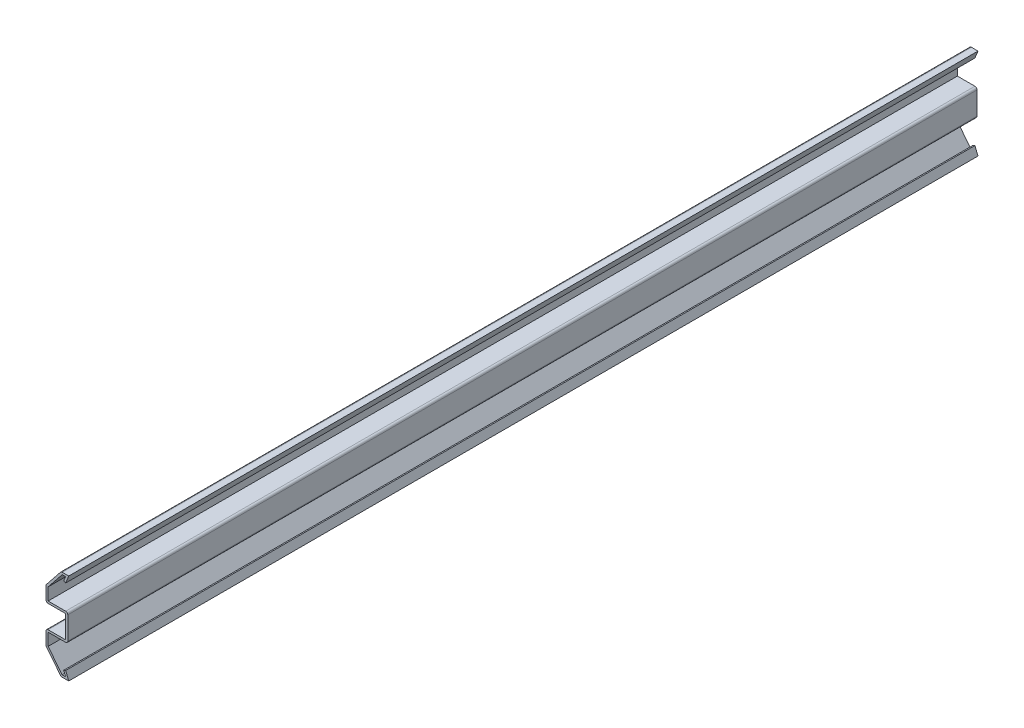
ISO-10303-21;
HEADER;
FILE_DESCRIPTION(('STEP AP214'),'2;1');
FILE_NAME('part.step','',(''),(''),'','','');
FILE_SCHEMA(('AUTOMOTIVE_DESIGN { 1 0 10303 214 1 1 1 1 }'));
ENDSEC;
DATA;
#1=APPLICATION_CONTEXT('core data for automotive mechanical design processes');
#2=APPLICATION_PROTOCOL_DEFINITION('international standard','automotive_design',2000,#1);
#3=PRODUCT_CONTEXT('',#1,'mechanical');
#4=PRODUCT('Part','Part','',(#3));
#5=PRODUCT_RELATED_PRODUCT_CATEGORY('part','',(#4));
#6=PRODUCT_DEFINITION_FORMATION('','',#4);
#7=PRODUCT_DEFINITION_CONTEXT('part definition',#1,'design');
#8=PRODUCT_DEFINITION('design','',#6,#7);
#9=PRODUCT_DEFINITION_SHAPE('','',#8);
#10=(LENGTH_UNIT() NAMED_UNIT(*) SI_UNIT(.MILLI.,.METRE.));
#11=(NAMED_UNIT(*) PLANE_ANGLE_UNIT() SI_UNIT($,.RADIAN.));
#12=(NAMED_UNIT(*) SI_UNIT($,.STERADIAN.) SOLID_ANGLE_UNIT());
#13=UNCERTAINTY_MEASURE_WITH_UNIT(LENGTH_MEASURE(1.E-05),#10,'distance_accuracy_value','');
#14=(GEOMETRIC_REPRESENTATION_CONTEXT(3) GLOBAL_UNCERTAINTY_ASSIGNED_CONTEXT((#13)) GLOBAL_UNIT_ASSIGNED_CONTEXT((#10,
#11,#12)) REPRESENTATION_CONTEXT('',''));
#15=CARTESIAN_POINT('',(0.,0.,0.));
#16=DIRECTION('',(0.,0.,1.));
#17=DIRECTION('',(1.,0.,0.));
#18=AXIS2_PLACEMENT_3D('',#15,#16,#17);
#19=CARTESIAN_POINT('',(-1.285875,3.175,-381.));
#20=DIRECTION('',(0.926870043752196,0.375382367719639,0.));
#21=DIRECTION('',(-0.375382367719639,0.926870043752196,0.));
#22=AXIS2_PLACEMENT_3D('',#19,#20,#21);
#23=PLANE('',#22);
#24=DIRECTION('',(-0.375382367719639,0.926870043752196,0.));
#25=VECTOR('',#24,1.);
#26=CARTESIAN_POINT('',(-1.285875,3.175,0.));
#27=LINE('',#26,#25);
#28=CARTESIAN_POINT('',(0.,0.,0.));
#29=VERTEX_POINT('',#28);
#30=CARTESIAN_POINT('',(-1.285875,3.175,0.));
#31=VERTEX_POINT('',#30);
#32=EDGE_CURVE('E327',#29,#31,#27,.T.);
#33=ORIENTED_EDGE('',*,*,#32,.F.);
#34=DIRECTION('',(0.,0.,1.));
#35=VECTOR('',#34,1.);
#36=CARTESIAN_POINT('',(0.,0.,-381.));
#37=LINE('',#36,#35);
#38=CARTESIAN_POINT('',(0.,0.,-381.));
#39=VERTEX_POINT('',#38);
#40=EDGE_CURVE('E270',#39,#29,#37,.T.);
#41=ORIENTED_EDGE('',*,*,#40,.F.);
#42=DIRECTION('',(-0.375382367719639,0.926870043752196,0.));
#43=VECTOR('',#42,1.);
#44=CARTESIAN_POINT('',(-1.285875,3.175,-381.));
#45=LINE('',#44,#43);
#46=CARTESIAN_POINT('',(-1.285875,3.175,-381.));
#47=VERTEX_POINT('',#46);
#48=EDGE_CURVE('E250',#39,#47,#45,.T.);
#49=ORIENTED_EDGE('',*,*,#48,.T.);
#50=DIRECTION('',(0.,0.,1.));
#51=VECTOR('',#50,1.);
#52=CARTESIAN_POINT('',(-1.285875,3.175,-381.));
#53=LINE('',#52,#51);
#54=EDGE_CURVE('E258',#47,#31,#53,.T.);
#55=ORIENTED_EDGE('',*,*,#54,.T.);
#56=EDGE_LOOP('',(#33,#41,#49,#55));
#57=FACE_BOUND('',#56,.T.);
#58=ADVANCED_FACE('F35',(#57),#23,.T.);
#59=CARTESIAN_POINT('',(0.,0.,-381.));
#60=DIRECTION('',(0.,-1.,0.));
#61=DIRECTION('',(1.,0.,0.));
#62=AXIS2_PLACEMENT_3D('',#59,#60,#61);
#63=PLANE('',#62);
#64=DIRECTION('',(1.,0.,0.));
#65=VECTOR('',#64,1.);
#66=CARTESIAN_POINT('',(0.,0.,0.));
#67=LINE('',#66,#65);
#68=CARTESIAN_POINT('',(-2.74772451058444,0.,0.));
#69=VERTEX_POINT('',#68);
#70=EDGE_CURVE('E271',#69,#29,#67,.T.);
#71=ORIENTED_EDGE('',*,*,#70,.F.);
#72=DIRECTION('',(0.,0.,1.));
#73=VECTOR('',#72,1.);
#74=CARTESIAN_POINT('',(-2.74772451058444,0.,-381.));
#75=LINE('',#74,#73);
#76=CARTESIAN_POINT('',(-2.74772451058444,0.,-381.));
#77=VERTEX_POINT('',#76);
#78=EDGE_CURVE('E439',#69,#77,#75,.F.);
#79=ORIENTED_EDGE('',*,*,#78,.T.);
#80=DIRECTION('',(1.,0.,0.));
#81=VECTOR('',#80,1.);
#82=CARTESIAN_POINT('',(0.,0.,-381.));
#83=LINE('',#82,#81);
#84=EDGE_CURVE('E266',#77,#39,#83,.T.);
#85=ORIENTED_EDGE('',*,*,#84,.T.);
#86=ORIENTED_EDGE('',*,*,#40,.T.);
#87=EDGE_LOOP('',(#71,#79,#85,#86));
#88=FACE_BOUND('',#87,.T.);
#89=ADVANCED_FACE('F568',(#88),#63,.T.);
#90=CARTESIAN_POINT('',(-3.175,0.,-381.));
#91=DIRECTION('',(-0.78086880944303,-0.624695047554424,0.));
#92=DIRECTION('',(0.624695047554424,-0.78086880944303,0.));
#93=AXIS2_PLACEMENT_3D('',#90,#91,#92);
#94=PLANE('',#93);
#95=DIRECTION('',(0.624695047554424,-0.78086880944303,0.));
#96=VECTOR('',#95,1.);
#97=CARTESIAN_POINT('',(-3.175,0.,-381.));
#98=LINE('',#97,#96);
#99=CARTESIAN_POINT('',(-9.33019237159486,7.69399046449357,-381.));
#100=VERTEX_POINT('',#99);
#101=CARTESIAN_POINT('',(-3.44191688217929,0.333646102724116,-381.));
#102=VERTEX_POINT('',#101);
#103=EDGE_CURVE('E323',#100,#102,#98,.T.);
#104=ORIENTED_EDGE('',*,*,#103,.T.);
#105=DIRECTION('',(0.,0.,1.));
#106=VECTOR('',#105,1.);
#107=CARTESIAN_POINT('',(-3.44191688217929,0.333646102724116,-381.));
#108=LINE('',#107,#106);
#109=CARTESIAN_POINT('',(-3.44191688217929,0.333646102724116,0.));
#110=VERTEX_POINT('',#109);
#111=EDGE_CURVE('E420',#102,#110,#108,.T.);
#112=ORIENTED_EDGE('',*,*,#111,.T.);
#113=DIRECTION('',(0.624695047554424,-0.78086880944303,0.));
#114=VECTOR('',#113,1.);
#115=CARTESIAN_POINT('',(-3.175,0.,0.));
#116=LINE('',#115,#114);
#117=CARTESIAN_POINT('',(-9.33019237159486,7.69399046449357,0.));
#118=VERTEX_POINT('',#117);
#119=EDGE_CURVE('E273',#118,#110,#116,.T.);
#120=ORIENTED_EDGE('',*,*,#119,.F.);
#121=DIRECTION('',(0.,0.,1.));
#122=VECTOR('',#121,1.);
#123=CARTESIAN_POINT('',(-9.33019237159486,7.69399046449357,-381.));
#124=LINE('',#123,#122);
#125=EDGE_CURVE('E381',#118,#100,#124,.F.);
#126=ORIENTED_EDGE('',*,*,#125,.T.);
#127=EDGE_LOOP('',(#104,#112,#120,#126));
#128=FACE_BOUND('',#127,.T.);
#129=ADVANCED_FACE('F576',(#128),#94,.T.);
#130=CARTESIAN_POINT('',(-9.525,7.9375,-381.));
#131=DIRECTION('',(-1.,0.,0.));
#132=DIRECTION('',(0.,-1.,0.));
#133=AXIS2_PLACEMENT_3D('',#130,#131,#132);
#134=PLANE('',#133);
#135=DIRECTION('',(0.,-1.,0.));
#136=VECTOR('',#135,1.);
#137=CARTESIAN_POINT('',(-9.525,7.9375,-381.));
#138=LINE('',#137,#136);
#139=CARTESIAN_POINT('',(-9.525,13.3985,-381.));
#140=VERTEX_POINT('',#139);
#141=CARTESIAN_POINT('',(-9.525,8.24934436176945,-381.));
#142=VERTEX_POINT('',#141);
#143=EDGE_CURVE('E320',#140,#142,#138,.T.);
#144=ORIENTED_EDGE('',*,*,#143,.T.);
#145=DIRECTION('',(0.,0.,1.));
#146=VECTOR('',#145,1.);
#147=CARTESIAN_POINT('',(-9.525,8.24934436176945,-381.));
#148=LINE('',#147,#146);
#149=CARTESIAN_POINT('',(-9.525,8.24934436176945,0.));
#150=VERTEX_POINT('',#149);
#151=EDGE_CURVE('E458',#142,#150,#148,.T.);
#152=ORIENTED_EDGE('',*,*,#151,.T.);
#153=DIRECTION('',(0.,-1.,0.));
#154=VECTOR('',#153,1.);
#155=CARTESIAN_POINT('',(-9.525,7.9375,0.));
#156=LINE('',#155,#154);
#157=CARTESIAN_POINT('',(-9.525,13.3985,0.));
#158=VERTEX_POINT('',#157);
#159=EDGE_CURVE('E375',#158,#150,#156,.T.);
#160=ORIENTED_EDGE('',*,*,#159,.F.);
#161=DIRECTION('',(0.,0.,1.));
#162=VECTOR('',#161,1.);
#163=CARTESIAN_POINT('',(-9.525,13.3985,-381.));
#164=LINE('',#163,#162);
#165=EDGE_CURVE('E456',#158,#140,#164,.F.);
#166=ORIENTED_EDGE('',*,*,#165,.T.);
#167=EDGE_LOOP('',(#144,#152,#160,#166));
#168=FACE_BOUND('',#167,.T.);
#169=ADVANCED_FACE('F584',(#168),#134,.T.);
#170=CARTESIAN_POINT('',(-9.525,14.2875,-381.));
#171=DIRECTION('',(0.,1.,0.));
#172=DIRECTION('',(0.,0.,1.));
#173=AXIS2_PLACEMENT_3D('',#170,#171,#172);
#174=PLANE('',#173);
#175=DIRECTION('',(-1.,0.,0.));
#176=VECTOR('',#175,1.);
#177=CARTESIAN_POINT('',(-9.525,14.2875,-381.));
#178=LINE('',#177,#176);
#179=CARTESIAN_POINT('',(-1.285875,14.2875,-381.));
#180=VERTEX_POINT('',#179);
#181=CARTESIAN_POINT('',(-8.636,14.2875,-381.));
#182=VERTEX_POINT('',#181);
#183=EDGE_CURVE('E317',#180,#182,#178,.T.);
#184=ORIENTED_EDGE('',*,*,#183,.T.);
#185=DIRECTION('',(0.,0.,1.));
#186=VECTOR('',#185,1.);
#187=CARTESIAN_POINT('',(-8.636,14.2875,-381.));
#188=LINE('',#187,#186);
#189=CARTESIAN_POINT('',(-8.636,14.2875,0.));
#190=VERTEX_POINT('',#189);
#191=EDGE_CURVE('E461',#182,#190,#188,.T.);
#192=ORIENTED_EDGE('',*,*,#191,.T.);
#193=DIRECTION('',(-1.,0.,0.));
#194=VECTOR('',#193,1.);
#195=CARTESIAN_POINT('',(-9.525,14.2875,0.));
#196=LINE('',#195,#194);
#197=CARTESIAN_POINT('',(-1.285875,14.2875,0.));
#198=VERTEX_POINT('',#197);
#199=EDGE_CURVE('E372',#198,#190,#196,.T.);
#200=ORIENTED_EDGE('',*,*,#199,.F.);
#201=DIRECTION('',(0.,0.,1.));
#202=VECTOR('',#201,1.);
#203=CARTESIAN_POINT('',(-1.285875,14.2875,-381.));
#204=LINE('',#203,#202);
#205=EDGE_CURVE('E382',#180,#198,#204,.T.);
#206=ORIENTED_EDGE('',*,*,#205,.F.);
#207=EDGE_LOOP('',(#184,#192,#200,#206));
#208=FACE_BOUND('',#207,.T.);
#209=ADVANCED_FACE('F594',(#208),#174,.T.);
#210=CARTESIAN_POINT('',(-1.285875,14.2875,-381.));
#211=DIRECTION('',(-1.,0.,0.));
#212=DIRECTION('',(0.,-1.,0.));
#213=AXIS2_PLACEMENT_3D('',#210,#211,#212);
#214=PLANE('',#213);
#215=DIRECTION('',(0.,-1.,0.));
#216=VECTOR('',#215,1.);
#217=CARTESIAN_POINT('',(-1.285875,14.2875,0.));
#218=LINE('',#217,#216);
#219=CARTESIAN_POINT('',(-1.285875,23.8125,0.));
#220=VERTEX_POINT('',#219);
#221=EDGE_CURVE('E369',#220,#198,#218,.T.);
#222=ORIENTED_EDGE('',*,*,#221,.F.);
#223=DIRECTION('',(0.,0.,1.));
#224=VECTOR('',#223,1.);
#225=CARTESIAN_POINT('',(-1.285875,23.8125,-381.));
#226=LINE('',#225,#224);
#227=CARTESIAN_POINT('',(-1.285875,23.8125,-381.));
#228=VERTEX_POINT('',#227);
#229=EDGE_CURVE('E384',#228,#220,#226,.T.);
#230=ORIENTED_EDGE('',*,*,#229,.F.);
#231=DIRECTION('',(0.,-1.,0.));
#232=VECTOR('',#231,1.);
#233=CARTESIAN_POINT('',(-1.285875,14.2875,-381.));
#234=LINE('',#233,#232);
#235=EDGE_CURVE('E314',#228,#180,#234,.T.);
#236=ORIENTED_EDGE('',*,*,#235,.T.);
#237=ORIENTED_EDGE('',*,*,#205,.T.);
#238=EDGE_LOOP('',(#222,#230,#236,#237));
#239=FACE_BOUND('',#238,.T.);
#240=ADVANCED_FACE('F599',(#239),#214,.T.);
#241=CARTESIAN_POINT('',(-9.525,23.8125,-381.));
#242=DIRECTION('',(0.,-1.,0.));
#243=DIRECTION('',(0.,0.,-1.));
#244=AXIS2_PLACEMENT_3D('',#241,#242,#243);
#245=PLANE('',#244);
#246=DIRECTION('',(1.,0.,0.));
#247=VECTOR('',#246,1.);
#248=CARTESIAN_POINT('',(-9.525,23.8125,0.));
#249=LINE('',#248,#247);
#250=CARTESIAN_POINT('',(-8.636,23.8125,0.));
#251=VERTEX_POINT('',#250);
#252=EDGE_CURVE('E367',#251,#220,#249,.T.);
#253=ORIENTED_EDGE('',*,*,#252,.F.);
#254=DIRECTION('',(0.,0.,1.));
#255=VECTOR('',#254,1.);
#256=CARTESIAN_POINT('',(-8.636,23.8125,-381.));
#257=LINE('',#256,#255);
#258=CARTESIAN_POINT('',(-8.636,23.8125,-381.));
#259=VERTEX_POINT('',#258);
#260=EDGE_CURVE('E478',#251,#259,#257,.F.);
#261=ORIENTED_EDGE('',*,*,#260,.T.);
#262=DIRECTION('',(1.,0.,0.));
#263=VECTOR('',#262,1.);
#264=CARTESIAN_POINT('',(-9.525,23.8125,-381.));
#265=LINE('',#264,#263);
#266=EDGE_CURVE('E312',#259,#228,#265,.T.);
#267=ORIENTED_EDGE('',*,*,#266,.T.);
#268=ORIENTED_EDGE('',*,*,#229,.T.);
#269=EDGE_LOOP('',(#253,#261,#267,#268));
#270=FACE_BOUND('',#269,.T.);
#271=ADVANCED_FACE('F612',(#270),#245,.T.);
#272=CARTESIAN_POINT('',(-9.525,30.1625,-381.));
#273=DIRECTION('',(-1.,0.,0.));
#274=DIRECTION('',(0.,-1.,0.));
#275=AXIS2_PLACEMENT_3D('',#272,#273,#274);
#276=PLANE('',#275);
#277=DIRECTION('',(0.,-1.,0.));
#278=VECTOR('',#277,1.);
#279=CARTESIAN_POINT('',(-9.525,30.1625,-381.));
#280=LINE('',#279,#278);
#281=CARTESIAN_POINT('',(-9.525,29.8506556382306,-381.));
#282=VERTEX_POINT('',#281);
#283=CARTESIAN_POINT('',(-9.525,24.7015,-381.));
#284=VERTEX_POINT('',#283);
#285=EDGE_CURVE('E309',#282,#284,#280,.T.);
#286=ORIENTED_EDGE('',*,*,#285,.T.);
#287=DIRECTION('',(0.,0.,1.));
#288=VECTOR('',#287,1.);
#289=CARTESIAN_POINT('',(-9.525,24.7015,-381.));
#290=LINE('',#289,#288);
#291=CARTESIAN_POINT('',(-9.525,24.7015,0.));
#292=VERTEX_POINT('',#291);
#293=EDGE_CURVE('E475',#284,#292,#290,.T.);
#294=ORIENTED_EDGE('',*,*,#293,.T.);
#295=DIRECTION('',(0.,-1.,0.));
#296=VECTOR('',#295,1.);
#297=CARTESIAN_POINT('',(-9.525,30.1625,0.));
#298=LINE('',#297,#296);
#299=CARTESIAN_POINT('',(-9.525,29.8506556382306,0.));
#300=VERTEX_POINT('',#299);
#301=EDGE_CURVE('E364',#300,#292,#298,.T.);
#302=ORIENTED_EDGE('',*,*,#301,.F.);
#303=DIRECTION('',(0.,0.,1.));
#304=VECTOR('',#303,1.);
#305=CARTESIAN_POINT('',(-9.525,29.8506556382306,-381.));
#306=LINE('',#305,#304);
#307=EDGE_CURVE('E473',#300,#282,#306,.F.);
#308=ORIENTED_EDGE('',*,*,#307,.T.);
#309=EDGE_LOOP('',(#286,#294,#302,#308));
#310=FACE_BOUND('',#309,.T.);
#311=ADVANCED_FACE('F610',(#310),#276,.T.);
#312=CARTESIAN_POINT('',(-3.175,38.1,-381.));
#313=DIRECTION('',(-0.78086880944303,0.624695047554424,0.));
#314=DIRECTION('',(-0.624695047554424,-0.78086880944303,0.));
#315=AXIS2_PLACEMENT_3D('',#312,#313,#314);
#316=PLANE('',#315);
#317=DIRECTION('',(-0.624695047554424,-0.78086880944303,0.));
#318=VECTOR('',#317,1.);
#319=CARTESIAN_POINT('',(-3.175,38.1,-381.));
#320=LINE('',#319,#318);
#321=CARTESIAN_POINT('',(-3.4419168821793,37.7663538972759,-381.));
#322=VERTEX_POINT('',#321);
#323=CARTESIAN_POINT('',(-9.33019237159485,30.4060095355064,-381.));
#324=VERTEX_POINT('',#323);
#325=EDGE_CURVE('E306',#322,#324,#320,.T.);
#326=ORIENTED_EDGE('',*,*,#325,.T.);
#327=DIRECTION('',(0.,0.,1.));
#328=VECTOR('',#327,1.);
#329=CARTESIAN_POINT('',(-9.33019237159485,30.4060095355064,-381.));
#330=LINE('',#329,#328);
#331=CARTESIAN_POINT('',(-9.33019237159485,30.4060095355064,0.));
#332=VERTEX_POINT('',#331);
#333=EDGE_CURVE('E43',#324,#332,#330,.T.);
#334=ORIENTED_EDGE('',*,*,#333,.T.);
#335=DIRECTION('',(-0.624695047554424,-0.78086880944303,0.));
#336=VECTOR('',#335,1.);
#337=CARTESIAN_POINT('',(-3.175,38.1,0.));
#338=LINE('',#337,#336);
#339=CARTESIAN_POINT('',(-3.4419168821793,37.7663538972759,0.));
#340=VERTEX_POINT('',#339);
#341=EDGE_CURVE('E361',#340,#332,#338,.T.);
#342=ORIENTED_EDGE('',*,*,#341,.F.);
#343=DIRECTION('',(0.,0.,1.));
#344=VECTOR('',#343,1.);
#345=CARTESIAN_POINT('',(-3.4419168821793,37.7663538972759,-381.));
#346=LINE('',#345,#344);
#347=EDGE_CURVE('E480',#340,#322,#346,.F.);
#348=ORIENTED_EDGE('',*,*,#347,.T.);
#349=EDGE_LOOP('',(#326,#334,#342,#348));
#350=FACE_BOUND('',#349,.T.);
#351=ADVANCED_FACE('F485',(#350),#316,.T.);
#352=CARTESIAN_POINT('',(0.,38.1,-381.));
#353=DIRECTION('',(0.,1.,0.));
#354=DIRECTION('',(0.,0.,1.));
#355=AXIS2_PLACEMENT_3D('',#352,#353,#354);
#356=PLANE('',#355);
#357=DIRECTION('',(-1.,0.,0.));
#358=VECTOR('',#357,1.);
#359=CARTESIAN_POINT('',(0.,38.1,-381.));
#360=LINE('',#359,#358);
#361=CARTESIAN_POINT('',(0.,38.1,-381.));
#362=VERTEX_POINT('',#361);
#363=CARTESIAN_POINT('',(-2.74772451058444,38.1,-381.));
#364=VERTEX_POINT('',#363);
#365=EDGE_CURVE('E303',#362,#364,#360,.T.);
#366=ORIENTED_EDGE('',*,*,#365,.T.);
#367=DIRECTION('',(0.,0.,1.));
#368=VECTOR('',#367,1.);
#369=CARTESIAN_POINT('',(-2.74772451058444,38.1,-381.));
#370=LINE('',#369,#368);
#371=CARTESIAN_POINT('',(-2.74772451058444,38.1,0.));
#372=VERTEX_POINT('',#371);
#373=EDGE_CURVE('E11',#364,#372,#370,.T.);
#374=ORIENTED_EDGE('',*,*,#373,.T.);
#375=DIRECTION('',(-1.,0.,0.));
#376=VECTOR('',#375,1.);
#377=CARTESIAN_POINT('',(0.,38.1,0.));
#378=LINE('',#377,#376);
#379=CARTESIAN_POINT('',(0.,38.1,0.));
#380=VERTEX_POINT('',#379);
#381=EDGE_CURVE('E358',#380,#372,#378,.T.);
#382=ORIENTED_EDGE('',*,*,#381,.F.);
#383=DIRECTION('',(0.,0.,1.));
#384=VECTOR('',#383,1.);
#385=CARTESIAN_POINT('',(0.,38.1,-381.));
#386=LINE('',#385,#384);
#387=EDGE_CURVE('E387',#362,#380,#386,.T.);
#388=ORIENTED_EDGE('',*,*,#387,.F.);
#389=EDGE_LOOP('',(#366,#374,#382,#388));
#390=FACE_BOUND('',#389,.T.);
#391=ADVANCED_FACE('F498',(#390),#356,.T.);
#392=CARTESIAN_POINT('',(-1.285875,34.925,-381.));
#393=DIRECTION('',(0.926870043752196,-0.37538236771964,0.));
#394=DIRECTION('',(0.37538236771964,0.926870043752196,0.));
#395=AXIS2_PLACEMENT_3D('',#392,#393,#394);
#396=PLANE('',#395);
#397=DIRECTION('',(0.37538236771964,0.926870043752196,0.));
#398=VECTOR('',#397,1.);
#399=CARTESIAN_POINT('',(-1.285875,34.925,0.));
#400=LINE('',#399,#398);
#401=CARTESIAN_POINT('',(-1.285875,34.925,0.));
#402=VERTEX_POINT('',#401);
#403=EDGE_CURVE('E355',#402,#380,#400,.T.);
#404=ORIENTED_EDGE('',*,*,#403,.F.);
#405=DIRECTION('',(0.,0.,1.));
#406=VECTOR('',#405,1.);
#407=CARTESIAN_POINT('',(-1.285875,34.925,-381.));
#408=LINE('',#407,#406);
#409=CARTESIAN_POINT('',(-1.285875,34.925,-381.));
#410=VERTEX_POINT('',#409);
#411=EDGE_CURVE('E389',#410,#402,#408,.T.);
#412=ORIENTED_EDGE('',*,*,#411,.F.);
#413=DIRECTION('',(0.37538236771964,0.926870043752196,0.));
#414=VECTOR('',#413,1.);
#415=CARTESIAN_POINT('',(-1.285875,34.925,-381.));
#416=LINE('',#415,#414);
#417=EDGE_CURVE('E300',#410,#362,#416,.T.);
#418=ORIENTED_EDGE('',*,*,#417,.T.);
#419=ORIENTED_EDGE('',*,*,#387,.T.);
#420=EDGE_LOOP('',(#404,#412,#418,#419));
#421=FACE_BOUND('',#420,.T.);
#422=ADVANCED_FACE('F503',(#421),#396,.T.);
#423=CARTESIAN_POINT('',(-1.285875,34.925,-381.));
#424=DIRECTION('',(0.375382367719638,0.926870043752197,0.));
#425=DIRECTION('',(-0.926870043752197,0.375382367719638,0.));
#426=AXIS2_PLACEMENT_3D('',#423,#424,#425);
#427=PLANE('',#426);
#428=DIRECTION('',(-0.926870043752197,0.375382367719638,0.));
#429=VECTOR('',#428,1.);
#430=CARTESIAN_POINT('',(-1.285875,34.925,0.));
#431=LINE('',#430,#429);
#432=CARTESIAN_POINT('',(-2.10986246889571,35.2587149249028,0.));
#433=VERTEX_POINT('',#432);
#434=EDGE_CURVE('E353',#402,#433,#431,.T.);
#435=ORIENTED_EDGE('',*,*,#434,.T.);
#436=DIRECTION('',(0.,0.,1.));
#437=VECTOR('',#436,1.);
#438=CARTESIAN_POINT('',(-2.10986246889571,35.2587149249028,-381.));
#439=LINE('',#438,#437);
#440=CARTESIAN_POINT('',(-2.10986246889571,35.2587149249028,-381.));
#441=VERTEX_POINT('',#440);
#442=EDGE_CURVE('E391',#441,#433,#439,.T.);
#443=ORIENTED_EDGE('',*,*,#442,.F.);
#444=DIRECTION('',(-0.926870043752197,0.375382367719638,0.));
#445=VECTOR('',#444,1.);
#446=CARTESIAN_POINT('',(-1.285875,34.925,-381.));
#447=LINE('',#446,#445);
#448=EDGE_CURVE('E298',#410,#441,#447,.T.);
#449=ORIENTED_EDGE('',*,*,#448,.F.);
#450=ORIENTED_EDGE('',*,*,#411,.T.);
#451=EDGE_LOOP('',(#435,#443,#449,#450));
#452=FACE_BOUND('',#451,.T.);
#453=ADVANCED_FACE('F508',(#452),#427,.F.);
#454=CARTESIAN_POINT('',(-2.10986246889571,35.2587149249028,-381.));
#455=DIRECTION('',(0.926870043752196,-0.37538236771964,0.));
#456=DIRECTION('',(0.37538236771964,0.926870043752196,0.));
#457=AXIS2_PLACEMENT_3D('',#454,#455,#456);
#458=PLANE('',#457);
#459=DIRECTION('',(0.37538236771964,0.926870043752196,0.));
#460=VECTOR('',#459,1.);
#461=CARTESIAN_POINT('',(-2.10986246889571,35.2587149249028,0.));
#462=LINE('',#461,#460);
#463=CARTESIAN_POINT('',(-1.31918701348132,37.211,0.));
#464=VERTEX_POINT('',#463);
#465=EDGE_CURVE('E351',#433,#464,#462,.T.);
#466=ORIENTED_EDGE('',*,*,#465,.T.);
#467=DIRECTION('',(0.,0.,1.));
#468=VECTOR('',#467,1.);
#469=CARTESIAN_POINT('',(-1.31918701348132,37.211,-381.));
#470=LINE('',#469,#468);
#471=CARTESIAN_POINT('',(-1.31918701348132,37.211,-381.));
#472=VERTEX_POINT('',#471);
#473=EDGE_CURVE('E394',#472,#464,#470,.T.);
#474=ORIENTED_EDGE('',*,*,#473,.F.);
#475=DIRECTION('',(0.37538236771964,0.926870043752196,0.));
#476=VECTOR('',#475,1.);
#477=CARTESIAN_POINT('',(-2.10986246889571,35.2587149249028,-381.));
#478=LINE('',#477,#476);
#479=EDGE_CURVE('E296',#441,#472,#478,.T.);
#480=ORIENTED_EDGE('',*,*,#479,.F.);
#481=ORIENTED_EDGE('',*,*,#442,.T.);
#482=EDGE_LOOP('',(#466,#474,#480,#481));
#483=FACE_BOUND('',#482,.T.);
#484=ADVANCED_FACE('F514',(#483),#458,.F.);
#485=CARTESIAN_POINT('',(0.,37.211,-381.));
#486=DIRECTION('',(0.,1.,0.));
#487=DIRECTION('',(0.,0.,1.));
#488=AXIS2_PLACEMENT_3D('',#485,#486,#487);
#489=PLANE('',#488);
#490=DIRECTION('',(1.,0.,0.));
#491=VECTOR('',#490,1.);
#492=CARTESIAN_POINT('',(0.,37.211,0.));
#493=LINE('',#492,#491);
#494=CARTESIAN_POINT('',(-2.74772451058444,37.211,0.));
#495=VERTEX_POINT('',#494);
#496=EDGE_CURVE('E349',#464,#495,#493,.F.);
#497=ORIENTED_EDGE('',*,*,#496,.T.);
#498=DIRECTION('',(0.,0.,1.));
#499=VECTOR('',#498,1.);
#500=CARTESIAN_POINT('',(-2.74772451058444,37.211,-381.));
#501=LINE('',#500,#499);
#502=CARTESIAN_POINT('',(-2.74772451058444,37.211,-381.));
#503=VERTEX_POINT('',#502);
#504=EDGE_CURVE('E397',#503,#495,#501,.T.);
#505=ORIENTED_EDGE('',*,*,#504,.F.);
#506=DIRECTION('',(1.,0.,0.));
#507=VECTOR('',#506,1.);
#508=CARTESIAN_POINT('',(0.,37.211,-381.));
#509=LINE('',#508,#507);
#510=EDGE_CURVE('E294',#472,#503,#509,.F.);
#511=ORIENTED_EDGE('',*,*,#510,.F.);
#512=ORIENTED_EDGE('',*,*,#473,.T.);
#513=EDGE_LOOP('',(#497,#505,#511,#512));
#514=FACE_BOUND('',#513,.T.);
#515=ADVANCED_FACE('F518',(#514),#489,.F.);
#516=CARTESIAN_POINT('',(-2.48080762840515,37.5446461027241,-381.));
#517=DIRECTION('',(-0.78086880944303,0.624695047554424,0.));
#518=DIRECTION('',(-0.624695047554424,-0.78086880944303,0.));
#519=AXIS2_PLACEMENT_3D('',#516,#517,#518);
#520=PLANE('',#519);
#521=DIRECTION('',(-0.624695047554424,-0.78086880944303,0.));
#522=VECTOR('',#521,1.);
#523=CARTESIAN_POINT('',(-2.48080762840515,37.5446461027241,0.));
#524=LINE('',#523,#522);
#525=CARTESIAN_POINT('',(-8.636,29.8506556382306,0.));
#526=VERTEX_POINT('',#525);
#527=EDGE_CURVE('E347',#495,#526,#524,.T.);
#528=ORIENTED_EDGE('',*,*,#527,.T.);
#529=DIRECTION('',(0.,0.,1.));
#530=VECTOR('',#529,1.);
#531=CARTESIAN_POINT('',(-8.636,29.8506556382306,-381.));
#532=LINE('',#531,#530);
#533=CARTESIAN_POINT('',(-8.636,29.8506556382306,-381.));
#534=VERTEX_POINT('',#533);
#535=EDGE_CURVE('E400',#534,#526,#532,.T.);
#536=ORIENTED_EDGE('',*,*,#535,.F.);
#537=DIRECTION('',(-0.624695047554424,-0.78086880944303,0.));
#538=VECTOR('',#537,1.);
#539=CARTESIAN_POINT('',(-2.48080762840515,37.5446461027241,-381.));
#540=LINE('',#539,#538);
#541=EDGE_CURVE('E292',#503,#534,#540,.T.);
#542=ORIENTED_EDGE('',*,*,#541,.F.);
#543=ORIENTED_EDGE('',*,*,#504,.T.);
#544=EDGE_LOOP('',(#528,#536,#542,#543));
#545=FACE_BOUND('',#544,.T.);
#546=ADVANCED_FACE('F523',(#545),#520,.F.);
#547=CARTESIAN_POINT('',(-8.636,30.1625,-381.));
#548=DIRECTION('',(-1.,0.,0.));
#549=DIRECTION('',(0.,-1.,0.));
#550=AXIS2_PLACEMENT_3D('',#547,#548,#549);
#551=PLANE('',#550);
#552=DIRECTION('',(0.,-1.,0.));
#553=VECTOR('',#552,1.);
#554=CARTESIAN_POINT('',(-8.636,30.1625,0.));
#555=LINE('',#554,#553);
#556=CARTESIAN_POINT('',(-8.636,24.7015,0.));
#557=VERTEX_POINT('',#556);
#558=EDGE_CURVE('E345',#526,#557,#555,.T.);
#559=ORIENTED_EDGE('',*,*,#558,.T.);
#560=DIRECTION('',(0.,0.,1.));
#561=VECTOR('',#560,1.);
#562=CARTESIAN_POINT('',(-8.636,24.7015,-381.));
#563=LINE('',#562,#561);
#564=CARTESIAN_POINT('',(-8.636,24.7015,-381.));
#565=VERTEX_POINT('',#564);
#566=EDGE_CURVE('E403',#565,#557,#563,.T.);
#567=ORIENTED_EDGE('',*,*,#566,.F.);
#568=DIRECTION('',(0.,-1.,0.));
#569=VECTOR('',#568,1.);
#570=CARTESIAN_POINT('',(-8.636,30.1625,-381.));
#571=LINE('',#570,#569);
#572=EDGE_CURVE('E290',#534,#565,#571,.T.);
#573=ORIENTED_EDGE('',*,*,#572,.F.);
#574=ORIENTED_EDGE('',*,*,#535,.T.);
#575=EDGE_LOOP('',(#559,#567,#573,#574));
#576=FACE_BOUND('',#575,.T.);
#577=ADVANCED_FACE('F529',(#576),#551,.F.);
#578=CARTESIAN_POINT('',(-9.525,24.7015,-381.));
#579=DIRECTION('',(0.,-1.,0.));
#580=DIRECTION('',(0.,0.,-1.));
#581=AXIS2_PLACEMENT_3D('',#578,#579,#580);
#582=PLANE('',#581);
#583=DIRECTION('',(1.,0.,0.));
#584=VECTOR('',#583,1.);
#585=CARTESIAN_POINT('',(-9.525,24.7015,0.));
#586=LINE('',#585,#584);
#587=CARTESIAN_POINT('',(-1.285875,24.7015,0.));
#588=VERTEX_POINT('',#587);
#589=EDGE_CURVE('E342',#557,#588,#586,.T.);
#590=ORIENTED_EDGE('',*,*,#589,.T.);
#591=DIRECTION('',(0.,0.,1.));
#592=VECTOR('',#591,1.);
#593=CARTESIAN_POINT('',(-1.285875,24.7015,-381.));
#594=LINE('',#593,#592);
#595=CARTESIAN_POINT('',(-1.285875,24.7015,-381.));
#596=VERTEX_POINT('',#595);
#597=EDGE_CURVE('E471',#588,#596,#594,.F.);
#598=ORIENTED_EDGE('',*,*,#597,.T.);
#599=DIRECTION('',(1.,0.,0.));
#600=VECTOR('',#599,1.);
#601=CARTESIAN_POINT('',(-9.525,24.7015,-381.));
#602=LINE('',#601,#600);
#603=EDGE_CURVE('E287',#565,#596,#602,.T.);
#604=ORIENTED_EDGE('',*,*,#603,.F.);
#605=ORIENTED_EDGE('',*,*,#566,.T.);
#606=EDGE_LOOP('',(#590,#598,#604,#605));
#607=FACE_BOUND('',#606,.T.);
#608=ADVANCED_FACE('F533',(#607),#582,.F.);
#609=CARTESIAN_POINT('',(-0.396875000000001,14.2875,-381.));
#610=DIRECTION('',(-1.,0.,0.));
#611=DIRECTION('',(0.,-1.,0.));
#612=AXIS2_PLACEMENT_3D('',#609,#610,#611);
#613=PLANE('',#612);
#614=DIRECTION('',(0.,-1.,0.));
#615=VECTOR('',#614,1.);
#616=CARTESIAN_POINT('',(-0.396875000000001,14.2875,0.));
#617=LINE('',#616,#615);
#618=CARTESIAN_POINT('',(-0.396875000000002,23.8125,0.));
#619=VERTEX_POINT('',#618);
#620=CARTESIAN_POINT('',(-0.396875000000001,14.2875,0.));
#621=VERTEX_POINT('',#620);
#622=EDGE_CURVE('E340',#619,#621,#617,.T.);
#623=ORIENTED_EDGE('',*,*,#622,.T.);
#624=DIRECTION('',(0.,0.,1.));
#625=VECTOR('',#624,1.);
#626=CARTESIAN_POINT('',(-0.396875000000001,14.2875,-381.));
#627=LINE('',#626,#625);
#628=CARTESIAN_POINT('',(-0.396875000000001,14.2875,-381.));
#629=VERTEX_POINT('',#628);
#630=EDGE_CURVE('E58',#621,#629,#627,.F.);
#631=ORIENTED_EDGE('',*,*,#630,.T.);
#632=DIRECTION('',(0.,-1.,0.));
#633=VECTOR('',#632,1.);
#634=CARTESIAN_POINT('',(-0.396875000000001,14.2875,-381.));
#635=LINE('',#634,#633);
#636=CARTESIAN_POINT('',(-0.396875000000002,23.8125,-381.));
#637=VERTEX_POINT('',#636);
#638=EDGE_CURVE('E285',#637,#629,#635,.T.);
#639=ORIENTED_EDGE('',*,*,#638,.F.);
#640=DIRECTION('',(0.,0.,1.));
#641=VECTOR('',#640,1.);
#642=CARTESIAN_POINT('',(-0.396875000000002,23.8125,-381.));
#643=LINE('',#642,#641);
#644=EDGE_CURVE('E467',#637,#619,#643,.T.);
#645=ORIENTED_EDGE('',*,*,#644,.T.);
#646=EDGE_LOOP('',(#623,#631,#639,#645));
#647=FACE_BOUND('',#646,.T.);
#648=ADVANCED_FACE('F538',(#647),#613,.F.);
#649=CARTESIAN_POINT('',(-9.525,13.3985,-381.));
#650=DIRECTION('',(0.,1.,0.));
#651=DIRECTION('',(0.,0.,1.));
#652=AXIS2_PLACEMENT_3D('',#649,#650,#651);
#653=PLANE('',#652);
#654=DIRECTION('',(1.,0.,0.));
#655=VECTOR('',#654,1.);
#656=CARTESIAN_POINT('',(-9.525,13.3985,-381.));
#657=LINE('',#656,#655);
#658=CARTESIAN_POINT('',(-1.285875,13.3985,-381.));
#659=VERTEX_POINT('',#658);
#660=CARTESIAN_POINT('',(-8.636,13.3985,-381.));
#661=VERTEX_POINT('',#660);
#662=EDGE_CURVE('E283',#659,#661,#657,.F.);
#663=ORIENTED_EDGE('',*,*,#662,.F.);
#664=DIRECTION('',(0.,0.,1.));
#665=VECTOR('',#664,1.);
#666=CARTESIAN_POINT('',(-1.285875,13.3985,-381.));
#667=LINE('',#666,#665);
#668=CARTESIAN_POINT('',(-1.285875,13.3985,0.));
#669=VERTEX_POINT('',#668);
#670=EDGE_CURVE('E464',#659,#669,#667,.T.);
#671=ORIENTED_EDGE('',*,*,#670,.T.);
#672=DIRECTION('',(1.,0.,0.));
#673=VECTOR('',#672,1.);
#674=CARTESIAN_POINT('',(-9.525,13.3985,0.));
#675=LINE('',#674,#673);
#676=CARTESIAN_POINT('',(-8.636,13.3985,0.));
#677=VERTEX_POINT('',#676);
#678=EDGE_CURVE('E338',#669,#677,#675,.F.);
#679=ORIENTED_EDGE('',*,*,#678,.T.);
#680=DIRECTION('',(0.,0.,1.));
#681=VECTOR('',#680,1.);
#682=CARTESIAN_POINT('',(-8.636,13.3985,-381.));
#683=LINE('',#682,#681);
#684=EDGE_CURVE('E406',#661,#677,#683,.T.);
#685=ORIENTED_EDGE('',*,*,#684,.F.);
#686=EDGE_LOOP('',(#663,#671,#679,#685));
#687=FACE_BOUND('',#686,.T.);
#688=ADVANCED_FACE('F546',(#687),#653,.F.);
#689=CARTESIAN_POINT('',(-8.636,7.9375,-381.));
#690=DIRECTION('',(-1.,0.,0.));
#691=DIRECTION('',(0.,-1.,0.));
#692=AXIS2_PLACEMENT_3D('',#689,#690,#691);
#693=PLANE('',#692);
#694=DIRECTION('',(0.,-1.,0.));
#695=VECTOR('',#694,1.);
#696=CARTESIAN_POINT('',(-8.636,7.9375,0.));
#697=LINE('',#696,#695);
#698=CARTESIAN_POINT('',(-8.636,8.24934436176945,0.));
#699=VERTEX_POINT('',#698);
#700=EDGE_CURVE('E336',#677,#699,#697,.T.);
#701=ORIENTED_EDGE('',*,*,#700,.T.);
#702=DIRECTION('',(0.,0.,1.));
#703=VECTOR('',#702,1.);
#704=CARTESIAN_POINT('',(-8.636,8.24934436176945,-381.));
#705=LINE('',#704,#703);
#706=CARTESIAN_POINT('',(-8.636,8.24934436176945,-381.));
#707=VERTEX_POINT('',#706);
#708=EDGE_CURVE('E409',#707,#699,#705,.T.);
#709=ORIENTED_EDGE('',*,*,#708,.F.);
#710=DIRECTION('',(0.,-1.,0.));
#711=VECTOR('',#710,1.);
#712=CARTESIAN_POINT('',(-8.636,7.9375,-381.));
#713=LINE('',#712,#711);
#714=EDGE_CURVE('E281',#661,#707,#713,.T.);
#715=ORIENTED_EDGE('',*,*,#714,.F.);
#716=ORIENTED_EDGE('',*,*,#684,.T.);
#717=EDGE_LOOP('',(#701,#709,#715,#716));
#718=FACE_BOUND('',#717,.T.);
#719=ADVANCED_FACE('F553',(#718),#693,.F.);
#720=CARTESIAN_POINT('',(-2.48080762840515,0.555353897275883,-381.));
#721=DIRECTION('',(-0.78086880944303,-0.624695047554424,0.));
#722=DIRECTION('',(0.624695047554424,-0.78086880944303,0.));
#723=AXIS2_PLACEMENT_3D('',#720,#721,#722);
#724=PLANE('',#723);
#725=DIRECTION('',(0.624695047554424,-0.78086880944303,0.));
#726=VECTOR('',#725,1.);
#727=CARTESIAN_POINT('',(-2.48080762840515,0.555353897275883,0.));
#728=LINE('',#727,#726);
#729=CARTESIAN_POINT('',(-2.74772451058444,0.889,0.));
#730=VERTEX_POINT('',#729);
#731=EDGE_CURVE('E334',#699,#730,#728,.T.);
#732=ORIENTED_EDGE('',*,*,#731,.T.);
#733=DIRECTION('',(0.,0.,1.));
#734=VECTOR('',#733,1.);
#735=CARTESIAN_POINT('',(-2.74772451058444,0.889,-381.));
#736=LINE('',#735,#734);
#737=CARTESIAN_POINT('',(-2.74772451058444,0.889,-381.));
#738=VERTEX_POINT('',#737);
#739=EDGE_CURVE('E412',#738,#730,#736,.T.);
#740=ORIENTED_EDGE('',*,*,#739,.F.);
#741=DIRECTION('',(0.624695047554424,-0.78086880944303,0.));
#742=VECTOR('',#741,1.);
#743=CARTESIAN_POINT('',(-2.48080762840515,0.555353897275883,-381.));
#744=LINE('',#743,#742);
#745=EDGE_CURVE('E279',#707,#738,#744,.T.);
#746=ORIENTED_EDGE('',*,*,#745,.F.);
#747=ORIENTED_EDGE('',*,*,#708,.T.);
#748=EDGE_LOOP('',(#732,#740,#746,#747));
#749=FACE_BOUND('',#748,.T.);
#750=ADVANCED_FACE('F556',(#749),#724,.F.);
#751=CARTESIAN_POINT('',(0.,0.889,-381.));
#752=DIRECTION('',(0.,-1.,0.));
#753=DIRECTION('',(1.,0.,0.));
#754=AXIS2_PLACEMENT_3D('',#751,#752,#753);
#755=PLANE('',#754);
#756=DIRECTION('',(1.,0.,0.));
#757=VECTOR('',#756,1.);
#758=CARTESIAN_POINT('',(0.,0.889,0.));
#759=LINE('',#758,#757);
#760=CARTESIAN_POINT('',(-1.31918701348132,0.889,0.));
#761=VERTEX_POINT('',#760);
#762=EDGE_CURVE('E332',#730,#761,#759,.T.);
#763=ORIENTED_EDGE('',*,*,#762,.T.);
#764=DIRECTION('',(0.,0.,1.));
#765=VECTOR('',#764,1.);
#766=CARTESIAN_POINT('',(-1.31918701348132,0.889,-381.));
#767=LINE('',#766,#765);
#768=CARTESIAN_POINT('',(-1.31918701348132,0.889,-381.));
#769=VERTEX_POINT('',#768);
#770=EDGE_CURVE('E415',#769,#761,#767,.T.);
#771=ORIENTED_EDGE('',*,*,#770,.F.);
#772=DIRECTION('',(1.,0.,0.));
#773=VECTOR('',#772,1.);
#774=CARTESIAN_POINT('',(0.,0.889,-381.));
#775=LINE('',#774,#773);
#776=EDGE_CURVE('E277',#738,#769,#775,.T.);
#777=ORIENTED_EDGE('',*,*,#776,.F.);
#778=ORIENTED_EDGE('',*,*,#739,.T.);
#779=EDGE_LOOP('',(#763,#771,#777,#778));
#780=FACE_BOUND('',#779,.T.);
#781=ADVANCED_FACE('F561',(#780),#755,.F.);
#782=CARTESIAN_POINT('',(-2.1098624688957,2.84128507509724,-381.));
#783=DIRECTION('',(0.926870043752196,0.375382367719639,0.));
#784=DIRECTION('',(-0.375382367719639,0.926870043752196,0.));
#785=AXIS2_PLACEMENT_3D('',#782,#783,#784);
#786=PLANE('',#785);
#787=DIRECTION('',(-0.375382367719639,0.926870043752196,0.));
#788=VECTOR('',#787,1.);
#789=CARTESIAN_POINT('',(-2.1098624688957,2.84128507509724,0.));
#790=LINE('',#789,#788);
#791=CARTESIAN_POINT('',(-2.1098624688957,2.84128507509724,0.));
#792=VERTEX_POINT('',#791);
#793=EDGE_CURVE('E330',#761,#792,#790,.T.);
#794=ORIENTED_EDGE('',*,*,#793,.T.);
#795=DIRECTION('',(0.,0.,1.));
#796=VECTOR('',#795,1.);
#797=CARTESIAN_POINT('',(-2.1098624688957,2.84128507509724,-381.));
#798=LINE('',#797,#796);
#799=CARTESIAN_POINT('',(-2.1098624688957,2.84128507509724,-381.));
#800=VERTEX_POINT('',#799);
#801=EDGE_CURVE('E265',#800,#792,#798,.T.);
#802=ORIENTED_EDGE('',*,*,#801,.F.);
#803=DIRECTION('',(-0.375382367719639,0.926870043752196,0.));
#804=VECTOR('',#803,1.);
#805=CARTESIAN_POINT('',(-2.1098624688957,2.84128507509724,-381.));
#806=LINE('',#805,#804);
#807=EDGE_CURVE('E252',#769,#800,#806,.T.);
#808=ORIENTED_EDGE('',*,*,#807,.F.);
#809=ORIENTED_EDGE('',*,*,#770,.T.);
#810=EDGE_LOOP('',(#794,#802,#808,#809));
#811=FACE_BOUND('',#810,.T.);
#812=ADVANCED_FACE('F564',(#811),#786,.F.);
#813=CARTESIAN_POINT('',(-2.1098624688957,2.84128507509724,-381.));
#814=DIRECTION('',(0.37538236771964,-0.926870043752196,0.));
#815=DIRECTION('',(0.926870043752196,0.37538236771964,0.));
#816=AXIS2_PLACEMENT_3D('',#813,#814,#815);
#817=PLANE('',#816);
#818=DIRECTION('',(0.926870043752196,0.37538236771964,0.));
#819=VECTOR('',#818,1.);
#820=CARTESIAN_POINT('',(-2.1098624688957,2.84128507509724,0.));
#821=LINE('',#820,#819);
#822=EDGE_CURVE('E261',#792,#31,#821,.T.);
#823=ORIENTED_EDGE('',*,*,#822,.T.);
#824=ORIENTED_EDGE('',*,*,#54,.F.);
#825=DIRECTION('',(0.926870043752196,0.37538236771964,0.));
#826=VECTOR('',#825,1.);
#827=CARTESIAN_POINT('',(-2.1098624688957,2.84128507509724,-381.));
#828=LINE('',#827,#826);
#829=EDGE_CURVE('E245',#800,#47,#828,.T.);
#830=ORIENTED_EDGE('',*,*,#829,.F.);
#831=ORIENTED_EDGE('',*,*,#801,.T.);
#832=EDGE_LOOP('',(#823,#824,#830,#831));
#833=FACE_BOUND('',#832,.T.);
#834=ADVANCED_FACE('F259',(#833),#817,.F.);
#835=CARTESIAN_POINT('',(0.,0.,-381.));
#836=DIRECTION('',(0.,0.,-1.));
#837=DIRECTION('',(-1.,0.,0.));
#838=AXIS2_PLACEMENT_3D('',#835,#836,#837);
#839=PLANE('',#838);
#840=ORIENTED_EDGE('',*,*,#84,.F.);
#841=CARTESIAN_POINT('',(-2.74772451058444,0.889,-381.));
#842=DIRECTION('',(0.,0.,-1.));
#843=DIRECTION('',(-1.,0.,0.));
#844=AXIS2_PLACEMENT_3D('',#841,#842,#843);
#845=CIRCLE('',#844,0.889);
#846=EDGE_CURVE('E454',#77,#102,#845,.T.);
#847=ORIENTED_EDGE('',*,*,#846,.T.);
#848=ORIENTED_EDGE('',*,*,#103,.F.);
#849=CARTESIAN_POINT('',(-8.636,8.24934436176945,-381.));
#850=DIRECTION('',(0.,0.,-1.));
#851=DIRECTION('',(-1.,0.,0.));
#852=AXIS2_PLACEMENT_3D('',#849,#850,#851);
#853=CIRCLE('',#852,0.889);
#854=EDGE_CURVE('E452',#100,#142,#853,.T.);
#855=ORIENTED_EDGE('',*,*,#854,.T.);
#856=ORIENTED_EDGE('',*,*,#143,.F.);
#857=CARTESIAN_POINT('',(-8.636,13.3985,-381.));
#858=DIRECTION('',(0.,0.,-1.));
#859=DIRECTION('',(-1.,0.,0.));
#860=AXIS2_PLACEMENT_3D('',#857,#858,#859);
#861=CIRCLE('',#860,0.889);
#862=EDGE_CURVE('E450',#140,#182,#861,.T.);
#863=ORIENTED_EDGE('',*,*,#862,.T.);
#864=ORIENTED_EDGE('',*,*,#183,.F.);
#865=ORIENTED_EDGE('',*,*,#235,.F.);
#866=ORIENTED_EDGE('',*,*,#266,.F.);
#867=CARTESIAN_POINT('',(-8.636,24.7015,-381.));
#868=DIRECTION('',(0.,0.,-1.));
#869=DIRECTION('',(-1.,0.,0.));
#870=AXIS2_PLACEMENT_3D('',#867,#868,#869);
#871=CIRCLE('',#870,0.889);
#872=EDGE_CURVE('E445',#259,#284,#871,.T.);
#873=ORIENTED_EDGE('',*,*,#872,.T.);
#874=ORIENTED_EDGE('',*,*,#285,.F.);
#875=CARTESIAN_POINT('',(-8.636,29.8506556382306,-381.));
#876=DIRECTION('',(0.,0.,-1.));
#877=DIRECTION('',(-1.,0.,0.));
#878=AXIS2_PLACEMENT_3D('',#875,#876,#877);
#879=CIRCLE('',#878,0.889);
#880=EDGE_CURVE('E443',#282,#324,#879,.T.);
#881=ORIENTED_EDGE('',*,*,#880,.T.);
#882=ORIENTED_EDGE('',*,*,#325,.F.);
#883=CARTESIAN_POINT('',(-2.74772451058444,37.211,-381.));
#884=DIRECTION('',(0.,0.,-1.));
#885=DIRECTION('',(-1.,0.,0.));
#886=AXIS2_PLACEMENT_3D('',#883,#884,#885);
#887=CIRCLE('',#886,0.889);
#888=EDGE_CURVE('E441',#322,#364,#887,.T.);
#889=ORIENTED_EDGE('',*,*,#888,.T.);
#890=ORIENTED_EDGE('',*,*,#365,.F.);
#891=ORIENTED_EDGE('',*,*,#417,.F.);
#892=ORIENTED_EDGE('',*,*,#448,.T.);
#893=ORIENTED_EDGE('',*,*,#479,.T.);
#894=ORIENTED_EDGE('',*,*,#510,.T.);
#895=ORIENTED_EDGE('',*,*,#541,.T.);
#896=ORIENTED_EDGE('',*,*,#572,.T.);
#897=ORIENTED_EDGE('',*,*,#603,.T.);
#898=CARTESIAN_POINT('',(-1.285875,23.8125,-381.));
#899=DIRECTION('',(0.,0.,-1.));
#900=DIRECTION('',(-1.,0.,0.));
#901=AXIS2_PLACEMENT_3D('',#898,#899,#900);
#902=CIRCLE('',#901,0.889);
#903=EDGE_CURVE('E447',#596,#637,#902,.T.);
#904=ORIENTED_EDGE('',*,*,#903,.T.);
#905=ORIENTED_EDGE('',*,*,#638,.T.);
#906=CARTESIAN_POINT('',(-1.285875,14.2875,-381.));
#907=DIRECTION('',(0.,0.,-1.));
#908=DIRECTION('',(-1.,0.,0.));
#909=AXIS2_PLACEMENT_3D('',#906,#907,#908);
#910=CIRCLE('',#909,0.889);
#911=EDGE_CURVE('E50',#629,#659,#910,.T.);
#912=ORIENTED_EDGE('',*,*,#911,.T.);
#913=ORIENTED_EDGE('',*,*,#662,.T.);
#914=ORIENTED_EDGE('',*,*,#714,.T.);
#915=ORIENTED_EDGE('',*,*,#745,.T.);
#916=ORIENTED_EDGE('',*,*,#776,.T.);
#917=ORIENTED_EDGE('',*,*,#807,.T.);
#918=ORIENTED_EDGE('',*,*,#829,.T.);
#919=ORIENTED_EDGE('',*,*,#48,.F.);
#920=EDGE_LOOP('',(#840,#847,#848,#855,#856,#863,#864,#865,#866,#873,#874,#881,#882,#889,#890,
#891,#892,#893,#894,#895,#896,#897,#904,#905,#912,#913,#914,#915,#916,#917,#918,#919));
#921=FACE_BOUND('',#920,.T.);
#922=ADVANCED_FACE('F248',(#921),#839,.T.);
#923=CARTESIAN_POINT('',(0.,0.,0.));
#924=DIRECTION('',(0.,0.,-1.));
#925=DIRECTION('',(-1.,0.,0.));
#926=AXIS2_PLACEMENT_3D('',#923,#924,#925);
#927=PLANE('',#926);
#928=ORIENTED_EDGE('',*,*,#119,.T.);
#929=CARTESIAN_POINT('',(-2.74772451058444,0.889,0.));
#930=DIRECTION('',(0.,0.,-1.));
#931=DIRECTION('',(-1.,0.,0.));
#932=AXIS2_PLACEMENT_3D('',#929,#930,#931);
#933=CIRCLE('',#932,0.889);
#934=EDGE_CURVE('E437',#110,#69,#933,.F.);
#935=ORIENTED_EDGE('',*,*,#934,.T.);
#936=ORIENTED_EDGE('',*,*,#70,.T.);
#937=ORIENTED_EDGE('',*,*,#32,.T.);
#938=ORIENTED_EDGE('',*,*,#822,.F.);
#939=ORIENTED_EDGE('',*,*,#793,.F.);
#940=ORIENTED_EDGE('',*,*,#762,.F.);
#941=ORIENTED_EDGE('',*,*,#731,.F.);
#942=ORIENTED_EDGE('',*,*,#700,.F.);
#943=ORIENTED_EDGE('',*,*,#678,.F.);
#944=CARTESIAN_POINT('',(-1.285875,14.2875,0.));
#945=DIRECTION('',(0.,0.,-1.));
#946=DIRECTION('',(-1.,0.,0.));
#947=AXIS2_PLACEMENT_3D('',#944,#945,#946);
#948=CIRCLE('',#947,0.889);
#949=EDGE_CURVE('E431',#669,#621,#948,.F.);
#950=ORIENTED_EDGE('',*,*,#949,.T.);
#951=ORIENTED_EDGE('',*,*,#622,.F.);
#952=CARTESIAN_POINT('',(-1.285875,23.8125,0.));
#953=DIRECTION('',(0.,0.,-1.));
#954=DIRECTION('',(-1.,0.,0.));
#955=AXIS2_PLACEMENT_3D('',#952,#953,#954);
#956=CIRCLE('',#955,0.889);
#957=EDGE_CURVE('E429',#619,#588,#956,.F.);
#958=ORIENTED_EDGE('',*,*,#957,.T.);
#959=ORIENTED_EDGE('',*,*,#589,.F.);
#960=ORIENTED_EDGE('',*,*,#558,.F.);
#961=ORIENTED_EDGE('',*,*,#527,.F.);
#962=ORIENTED_EDGE('',*,*,#496,.F.);
#963=ORIENTED_EDGE('',*,*,#465,.F.);
#964=ORIENTED_EDGE('',*,*,#434,.F.);
#965=ORIENTED_EDGE('',*,*,#403,.T.);
#966=ORIENTED_EDGE('',*,*,#381,.T.);
#967=CARTESIAN_POINT('',(-2.74772451058444,37.211,0.));
#968=DIRECTION('',(0.,0.,-1.));
#969=DIRECTION('',(-1.,0.,0.));
#970=AXIS2_PLACEMENT_3D('',#967,#968,#969);
#971=CIRCLE('',#970,0.889);
#972=EDGE_CURVE('E423',#372,#340,#971,.F.);
#973=ORIENTED_EDGE('',*,*,#972,.T.);
#974=ORIENTED_EDGE('',*,*,#341,.T.);
#975=CARTESIAN_POINT('',(-8.636,29.8506556382306,0.));
#976=DIRECTION('',(0.,0.,-1.));
#977=DIRECTION('',(-1.,0.,0.));
#978=AXIS2_PLACEMENT_3D('',#975,#976,#977);
#979=CIRCLE('',#978,0.889);
#980=EDGE_CURVE('E425',#332,#300,#979,.F.);
#981=ORIENTED_EDGE('',*,*,#980,.T.);
#982=ORIENTED_EDGE('',*,*,#301,.T.);
#983=CARTESIAN_POINT('',(-8.636,24.7015,0.));
#984=DIRECTION('',(0.,0.,-1.));
#985=DIRECTION('',(-1.,0.,0.));
#986=AXIS2_PLACEMENT_3D('',#983,#984,#985);
#987=CIRCLE('',#986,0.889);
#988=EDGE_CURVE('E427',#292,#251,#987,.F.);
#989=ORIENTED_EDGE('',*,*,#988,.T.);
#990=ORIENTED_EDGE('',*,*,#252,.T.);
#991=ORIENTED_EDGE('',*,*,#221,.T.);
#992=ORIENTED_EDGE('',*,*,#199,.T.);
#993=CARTESIAN_POINT('',(-8.636,13.3985,0.));
#994=DIRECTION('',(0.,0.,-1.));
#995=DIRECTION('',(-1.,0.,0.));
#996=AXIS2_PLACEMENT_3D('',#993,#994,#995);
#997=CIRCLE('',#996,0.889);
#998=EDGE_CURVE('E433',#190,#158,#997,.F.);
#999=ORIENTED_EDGE('',*,*,#998,.T.);
#1000=ORIENTED_EDGE('',*,*,#159,.T.);
#1001=CARTESIAN_POINT('',(-8.636,8.24934436176945,0.));
#1002=DIRECTION('',(0.,0.,-1.));
#1003=DIRECTION('',(-1.,0.,0.));
#1004=AXIS2_PLACEMENT_3D('',#1001,#1002,#1003);
#1005=CIRCLE('',#1004,0.889);
#1006=EDGE_CURVE('E435',#150,#118,#1005,.F.);
#1007=ORIENTED_EDGE('',*,*,#1006,.T.);
#1008=EDGE_LOOP('',(#928,#935,#936,#937,#938,#939,#940,#941,#942,#943,#950,#951,#958,#959,#960,
#961,#962,#963,#964,#965,#966,#973,#974,#981,#982,#989,#990,#991,#992,#999,#1000,#1007));
#1009=FACE_BOUND('',#1008,.T.);
#1010=ADVANCED_FACE('F491',(#1009),#927,.F.);
#1011=CARTESIAN_POINT('',(-2.74772451058444,0.889,-381.));
#1012=DIRECTION('',(0.,0.,1.));
#1013=DIRECTION('',(1.,0.,0.));
#1014=AXIS2_PLACEMENT_3D('',#1011,#1012,#1013);
#1015=CYLINDRICAL_SURFACE('',#1014,0.889);
#1016=ORIENTED_EDGE('',*,*,#846,.F.);
#1017=ORIENTED_EDGE('',*,*,#78,.F.);
#1018=ORIENTED_EDGE('',*,*,#934,.F.);
#1019=ORIENTED_EDGE('',*,*,#111,.F.);
#1020=EDGE_LOOP('',(#1016,#1017,#1018,#1019));
#1021=FACE_BOUND('',#1020,.T.);
#1022=ADVANCED_FACE('F573',(#1021),#1015,.T.);
#1023=CARTESIAN_POINT('',(-8.636,8.24934436176945,-381.));
#1024=DIRECTION('',(0.,0.,1.));
#1025=DIRECTION('',(1.,0.,0.));
#1026=AXIS2_PLACEMENT_3D('',#1023,#1024,#1025);
#1027=CYLINDRICAL_SURFACE('',#1026,0.889);
#1028=ORIENTED_EDGE('',*,*,#854,.F.);
#1029=ORIENTED_EDGE('',*,*,#125,.F.);
#1030=ORIENTED_EDGE('',*,*,#1006,.F.);
#1031=ORIENTED_EDGE('',*,*,#151,.F.);
#1032=EDGE_LOOP('',(#1028,#1029,#1030,#1031));
#1033=FACE_BOUND('',#1032,.T.);
#1034=ADVANCED_FACE('F582',(#1033),#1027,.T.);
#1035=CARTESIAN_POINT('',(-8.636,13.3985,-381.));
#1036=DIRECTION('',(0.,0.,1.));
#1037=DIRECTION('',(1.,0.,0.));
#1038=AXIS2_PLACEMENT_3D('',#1035,#1036,#1037);
#1039=CYLINDRICAL_SURFACE('',#1038,0.889);
#1040=ORIENTED_EDGE('',*,*,#862,.F.);
#1041=ORIENTED_EDGE('',*,*,#165,.F.);
#1042=ORIENTED_EDGE('',*,*,#998,.F.);
#1043=ORIENTED_EDGE('',*,*,#191,.F.);
#1044=EDGE_LOOP('',(#1040,#1041,#1042,#1043));
#1045=FACE_BOUND('',#1044,.T.);
#1046=ADVANCED_FACE('F591',(#1045),#1039,.T.);
#1047=CARTESIAN_POINT('',(-1.285875,14.2875,-381.));
#1048=DIRECTION('',(0.,0.,1.));
#1049=DIRECTION('',(1.,0.,0.));
#1050=AXIS2_PLACEMENT_3D('',#1047,#1048,#1049);
#1051=CYLINDRICAL_SURFACE('',#1050,0.889);
#1052=ORIENTED_EDGE('',*,*,#911,.F.);
#1053=ORIENTED_EDGE('',*,*,#630,.F.);
#1054=ORIENTED_EDGE('',*,*,#949,.F.);
#1055=ORIENTED_EDGE('',*,*,#670,.F.);
#1056=EDGE_LOOP('',(#1052,#1053,#1054,#1055));
#1057=FACE_BOUND('',#1056,.T.);
#1058=ADVANCED_FACE('F544',(#1057),#1051,.T.);
#1059=CARTESIAN_POINT('',(-1.285875,23.8125,-381.));
#1060=DIRECTION('',(0.,0.,1.));
#1061=DIRECTION('',(1.,0.,0.));
#1062=AXIS2_PLACEMENT_3D('',#1059,#1060,#1061);
#1063=CYLINDRICAL_SURFACE('',#1062,0.889);
#1064=ORIENTED_EDGE('',*,*,#903,.F.);
#1065=ORIENTED_EDGE('',*,*,#597,.F.);
#1066=ORIENTED_EDGE('',*,*,#957,.F.);
#1067=ORIENTED_EDGE('',*,*,#644,.F.);
#1068=EDGE_LOOP('',(#1064,#1065,#1066,#1067));
#1069=FACE_BOUND('',#1068,.T.);
#1070=ADVANCED_FACE('F536',(#1069),#1063,.T.);
#1071=CARTESIAN_POINT('',(-8.636,24.7015,-381.));
#1072=DIRECTION('',(0.,0.,1.));
#1073=DIRECTION('',(1.,0.,0.));
#1074=AXIS2_PLACEMENT_3D('',#1071,#1072,#1073);
#1075=CYLINDRICAL_SURFACE('',#1074,0.889);
#1076=ORIENTED_EDGE('',*,*,#872,.F.);
#1077=ORIENTED_EDGE('',*,*,#260,.F.);
#1078=ORIENTED_EDGE('',*,*,#988,.F.);
#1079=ORIENTED_EDGE('',*,*,#293,.F.);
#1080=EDGE_LOOP('',(#1076,#1077,#1078,#1079));
#1081=FACE_BOUND('',#1080,.T.);
#1082=ADVANCED_FACE('F608',(#1081),#1075,.T.);
#1083=CARTESIAN_POINT('',(-8.636,29.8506556382306,-381.));
#1084=DIRECTION('',(0.,0.,1.));
#1085=DIRECTION('',(1.,0.,0.));
#1086=AXIS2_PLACEMENT_3D('',#1083,#1084,#1085);
#1087=CYLINDRICAL_SURFACE('',#1086,0.889);
#1088=ORIENTED_EDGE('',*,*,#880,.F.);
#1089=ORIENTED_EDGE('',*,*,#307,.F.);
#1090=ORIENTED_EDGE('',*,*,#980,.F.);
#1091=ORIENTED_EDGE('',*,*,#333,.F.);
#1092=EDGE_LOOP('',(#1088,#1089,#1090,#1091));
#1093=FACE_BOUND('',#1092,.T.);
#1094=ADVANCED_FACE('F641',(#1093),#1087,.T.);
#1095=CARTESIAN_POINT('',(-2.74772451058444,37.211,-381.));
#1096=DIRECTION('',(0.,0.,1.));
#1097=DIRECTION('',(1.,0.,0.));
#1098=AXIS2_PLACEMENT_3D('',#1095,#1096,#1097);
#1099=CYLINDRICAL_SURFACE('',#1098,0.889);
#1100=ORIENTED_EDGE('',*,*,#888,.F.);
#1101=ORIENTED_EDGE('',*,*,#347,.F.);
#1102=ORIENTED_EDGE('',*,*,#972,.F.);
#1103=ORIENTED_EDGE('',*,*,#373,.F.);
#1104=EDGE_LOOP('',(#1100,#1101,#1102,#1103));
#1105=FACE_BOUND('',#1104,.T.);
#1106=ADVANCED_FACE('F37',(#1105),#1099,.T.);
#1107=CLOSED_SHELL('',(#58,#89,#129,#169,#209,#240,#271,#311,#351,#391,#422,#453,#484,#515,#546,
#577,#608,#648,#688,#719,#750,#781,#812,#834,#922,#1010,#1022,#1034,#1046,#1058,#1070,#1082,
#1094,#1106));
#1108=MANIFOLD_SOLID_BREP('B2',#1107);
#1109=ADVANCED_BREP_SHAPE_REPRESENTATION('',(#18,#1108),#14);
#1110=SHAPE_DEFINITION_REPRESENTATION(#9,#1109);
ENDSEC;
END-ISO-10303-21;
